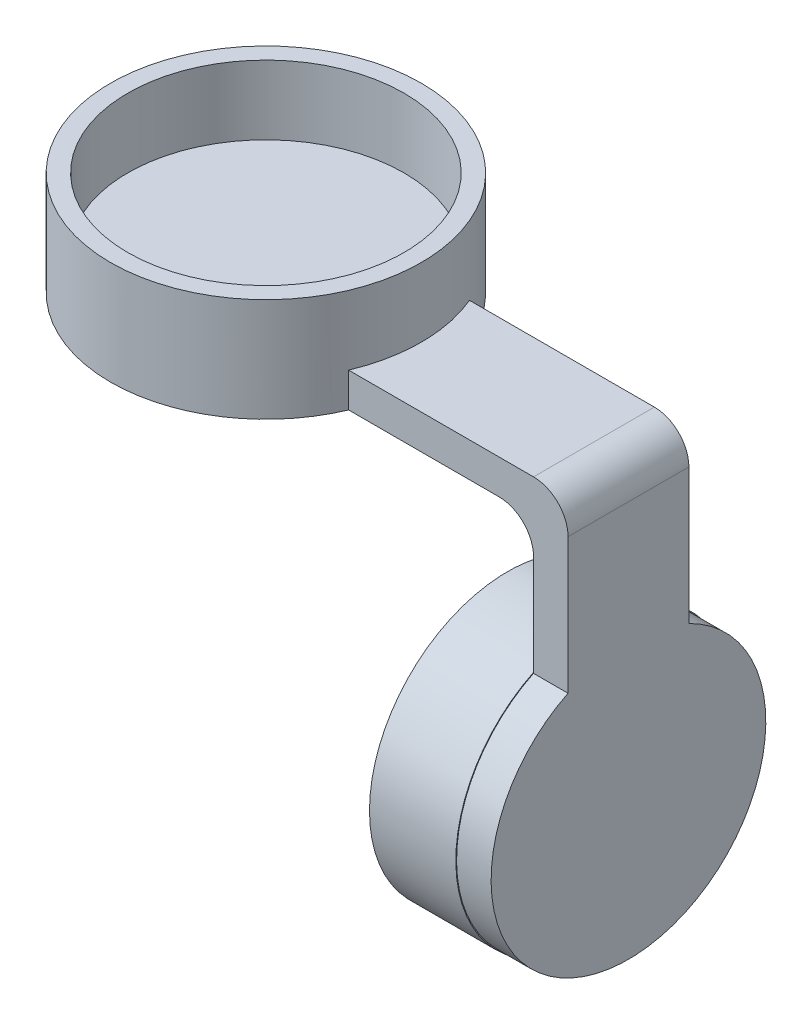
ISO-10303-21;
HEADER;
FILE_DESCRIPTION(('STEP AP214'),'2;1');
FILE_NAME('part.step','',(''),(''),'','','');
FILE_SCHEMA(('AUTOMOTIVE_DESIGN { 1 0 10303 214 1 1 1 1 }'));
ENDSEC;
DATA;
#1=APPLICATION_CONTEXT('core data for automotive mechanical design processes');
#2=APPLICATION_PROTOCOL_DEFINITION('international standard','automotive_design',2000,#1);
#3=PRODUCT_CONTEXT('',#1,'mechanical');
#4=PRODUCT('Part','Part','',(#3));
#5=PRODUCT_RELATED_PRODUCT_CATEGORY('part','',(#4));
#6=PRODUCT_DEFINITION_FORMATION('','',#4);
#7=PRODUCT_DEFINITION_CONTEXT('part definition',#1,'design');
#8=PRODUCT_DEFINITION('design','',#6,#7);
#9=PRODUCT_DEFINITION_SHAPE('','',#8);
#10=(LENGTH_UNIT() NAMED_UNIT(*) SI_UNIT(.MILLI.,.METRE.));
#11=(NAMED_UNIT(*) PLANE_ANGLE_UNIT() SI_UNIT($,.RADIAN.));
#12=(NAMED_UNIT(*) SI_UNIT($,.STERADIAN.) SOLID_ANGLE_UNIT());
#13=UNCERTAINTY_MEASURE_WITH_UNIT(LENGTH_MEASURE(1.E-05),#10,'distance_accuracy_value','');
#14=(GEOMETRIC_REPRESENTATION_CONTEXT(3) GLOBAL_UNCERTAINTY_ASSIGNED_CONTEXT((#13)) GLOBAL_UNIT_ASSIGNED_CONTEXT((#10,
#11,#12)) REPRESENTATION_CONTEXT('',''));
#15=CARTESIAN_POINT('',(0.,0.,0.));
#16=DIRECTION('',(0.,0.,1.));
#17=DIRECTION('',(1.,0.,0.));
#18=AXIS2_PLACEMENT_3D('',#15,#16,#17);
#19=CARTESIAN_POINT('',(-10.,0.,0.));
#20=DIRECTION('',(1.,0.,0.));
#21=DIRECTION('',(0.,0.,-1.));
#22=AXIS2_PLACEMENT_3D('',#19,#20,#21);
#23=CYLINDRICAL_SURFACE('',#22,16.);
#24=CARTESIAN_POINT('',(-10.,0.,0.));
#25=DIRECTION('',(1.,0.,0.));
#26=DIRECTION('',(0.,0.,-1.));
#27=AXIS2_PLACEMENT_3D('',#24,#25,#26);
#28=CIRCLE('',#27,16.);
#29=CARTESIAN_POINT('',(-10.,0.,-16.));
#30=VERTEX_POINT('',#29);
#31=EDGE_CURVE('E196',#30,#30,#28,.T.);
#32=ORIENTED_EDGE('',*,*,#31,.T.);
#33=EDGE_LOOP('',(#32));
#34=FACE_BOUND('',#33,.T.);
#35=CARTESIAN_POINT('',(0.,0.,0.));
#36=DIRECTION('',(1.,0.,0.));
#37=DIRECTION('',(0.,0.,-1.));
#38=AXIS2_PLACEMENT_3D('',#35,#36,#37);
#39=CIRCLE('',#38,16.);
#40=CARTESIAN_POINT('',(0.,14.3874945699382,-7.));
#41=VERTEX_POINT('',#40);
#42=CARTESIAN_POINT('',(0.,14.3874945699382,7.));
#43=VERTEX_POINT('',#42);
#44=EDGE_CURVE('E198',#41,#43,#39,.T.);
#45=ORIENTED_EDGE('',*,*,#44,.F.);
#46=EDGE_CURVE('E193',#43,#41,#39,.T.);
#47=ORIENTED_EDGE('',*,*,#46,.F.);
#48=EDGE_LOOP('',(#45,#47));
#49=FACE_BOUND('',#48,.T.);
#50=ADVANCED_FACE('F43',(#34,#49),#23,.T.);
#51=CARTESIAN_POINT('',(-10.,0.,0.));
#52=DIRECTION('',(1.,0.,0.));
#53=DIRECTION('',(0.,0.,-1.));
#54=AXIS2_PLACEMENT_3D('',#51,#52,#53);
#55=PLANE('',#54);
#56=CARTESIAN_POINT('',(-10.,0.,0.));
#57=DIRECTION('',(1.,0.,0.));
#58=DIRECTION('',(0.,0.,-1.));
#59=AXIS2_PLACEMENT_3D('',#56,#57,#58);
#60=CIRCLE('',#59,14.);
#61=CARTESIAN_POINT('',(-10.,0.,-14.));
#62=VERTEX_POINT('',#61);
#63=EDGE_CURVE('E190',#62,#62,#60,.T.);
#64=ORIENTED_EDGE('',*,*,#63,.T.);
#65=EDGE_LOOP('',(#64));
#66=FACE_BOUND('',#65,.T.);
#67=ORIENTED_EDGE('',*,*,#31,.F.);
#68=EDGE_LOOP('',(#67));
#69=FACE_BOUND('',#68,.T.);
#70=ADVANCED_FACE('F235',(#66,#69),#55,.F.);
#71=CARTESIAN_POINT('',(0.,0.,0.));
#72=DIRECTION('',(1.,0.,0.));
#73=DIRECTION('',(0.,0.,-1.));
#74=AXIS2_PLACEMENT_3D('',#71,#72,#73);
#75=PLANE('',#74);
#76=DIRECTION('',(0.,1.,0.));
#77=VECTOR('',#76,1.);
#78=CARTESIAN_POINT('',(0.,14.2889435024674,-7.));
#79=LINE('',#78,#77);
#80=CARTESIAN_POINT('',(0.,14.2889435024674,-7.));
#81=VERTEX_POINT('',#80);
#82=EDGE_CURVE('E176',#81,#41,#79,.T.);
#83=ORIENTED_EDGE('',*,*,#82,.F.);
#84=CARTESIAN_POINT('',(0.,0.,0.));
#85=DIRECTION('',(1.,0.,0.));
#86=DIRECTION('',(0.,0.,-1.));
#87=AXIS2_PLACEMENT_3D('',#84,#85,#86);
#88=CIRCLE('',#87,15.9114394828596);
#89=CARTESIAN_POINT('',(0.,14.2889435024674,7.));
#90=VERTEX_POINT('',#89);
#91=EDGE_CURVE('E171',#90,#81,#88,.T.);
#92=ORIENTED_EDGE('',*,*,#91,.F.);
#93=DIRECTION('',(0.,-1.,0.));
#94=VECTOR('',#93,1.);
#95=CARTESIAN_POINT('',(0.,14.2889435024674,7.));
#96=LINE('',#95,#94);
#97=EDGE_CURVE('E50',#43,#90,#96,.T.);
#98=ORIENTED_EDGE('',*,*,#97,.F.);
#99=ORIENTED_EDGE('',*,*,#46,.T.);
#100=EDGE_LOOP('',(#83,#92,#98,#99));
#101=FACE_BOUND('',#100,.T.);
#102=ADVANCED_FACE('F205',(#101),#75,.T.);
#103=CARTESIAN_POINT('',(-10.,0.,0.));
#104=DIRECTION('',(1.,0.,0.));
#105=DIRECTION('',(0.,0.,-1.));
#106=AXIS2_PLACEMENT_3D('',#103,#104,#105);
#107=CYLINDRICAL_SURFACE('',#106,14.);
#108=ORIENTED_EDGE('',*,*,#63,.F.);
#109=EDGE_LOOP('',(#108));
#110=FACE_BOUND('',#109,.T.);
#111=CARTESIAN_POINT('',(0.,0.,0.));
#112=DIRECTION('',(1.,0.,0.));
#113=DIRECTION('',(0.,0.,-1.));
#114=AXIS2_PLACEMENT_3D('',#111,#112,#113);
#115=CIRCLE('',#114,14.);
#116=CARTESIAN_POINT('',(0.,0.,-14.));
#117=VERTEX_POINT('',#116);
#118=EDGE_CURVE('E189',#117,#117,#115,.T.);
#119=ORIENTED_EDGE('',*,*,#118,.T.);
#120=EDGE_LOOP('',(#119));
#121=FACE_BOUND('',#120,.T.);
#122=ADVANCED_FACE('F247',(#110,#121),#107,.F.);
#123=CARTESIAN_POINT('',(4.,0.,0.));
#124=DIRECTION('',(1.,0.,0.));
#125=DIRECTION('',(0.,0.,-1.));
#126=AXIS2_PLACEMENT_3D('',#123,#124,#125);
#127=PLANE('',#126);
#128=DIRECTION('',(0.,1.,0.));
#129=VECTOR('',#128,1.);
#130=CARTESIAN_POINT('',(4.,14.2889435024674,-7.));
#131=LINE('',#130,#129);
#132=CARTESIAN_POINT('',(4.,14.2889435024674,-7.));
#133=VERTEX_POINT('',#132);
#134=CARTESIAN_POINT('',(4.,30.,-7.));
#135=VERTEX_POINT('',#134);
#136=EDGE_CURVE('E168',#133,#135,#131,.T.);
#137=ORIENTED_EDGE('',*,*,#136,.T.);
#138=DIRECTION('',(0.,0.,-1.));
#139=VECTOR('',#138,1.);
#140=CARTESIAN_POINT('',(4.,30.,7.));
#141=LINE('',#140,#139);
#142=CARTESIAN_POINT('',(4.,30.,7.));
#143=VERTEX_POINT('',#142);
#144=EDGE_CURVE('E158',#143,#135,#141,.T.);
#145=ORIENTED_EDGE('',*,*,#144,.F.);
#146=DIRECTION('',(0.,-1.,0.));
#147=VECTOR('',#146,1.);
#148=CARTESIAN_POINT('',(4.,14.2889435024674,7.));
#149=LINE('',#148,#147);
#150=CARTESIAN_POINT('',(4.,14.2889435024674,7.));
#151=VERTEX_POINT('',#150);
#152=EDGE_CURVE('E170',#143,#151,#149,.T.);
#153=ORIENTED_EDGE('',*,*,#152,.T.);
#154=CARTESIAN_POINT('',(4.,0.,0.));
#155=DIRECTION('',(1.,0.,0.));
#156=DIRECTION('',(0.,0.,-1.));
#157=AXIS2_PLACEMENT_3D('',#154,#155,#156);
#158=CIRCLE('',#157,15.9114394828596);
#159=EDGE_CURVE('E173',#151,#133,#158,.T.);
#160=ORIENTED_EDGE('',*,*,#159,.T.);
#161=EDGE_LOOP('',(#137,#145,#153,#160));
#162=FACE_BOUND('',#161,.T.);
#163=ADVANCED_FACE('F251',(#162),#127,.T.);
#164=CARTESIAN_POINT('',(4.,0.,0.));
#165=DIRECTION('',(-1.,0.,0.));
#166=DIRECTION('',(0.,0.,1.));
#167=AXIS2_PLACEMENT_3D('',#164,#165,#166);
#168=CYLINDRICAL_SURFACE('',#167,15.9114394828596);
#169=ORIENTED_EDGE('',*,*,#91,.T.);
#170=DIRECTION('',(-1.,0.,0.));
#171=VECTOR('',#170,1.);
#172=CARTESIAN_POINT('',(4.,14.2889435024674,-7.));
#173=LINE('',#172,#171);
#174=EDGE_CURVE('E175',#133,#81,#173,.T.);
#175=ORIENTED_EDGE('',*,*,#174,.F.);
#176=ORIENTED_EDGE('',*,*,#159,.F.);
#177=DIRECTION('',(-1.,0.,0.));
#178=VECTOR('',#177,1.);
#179=CARTESIAN_POINT('',(4.,14.2889435024674,7.));
#180=LINE('',#179,#178);
#181=EDGE_CURVE('E186',#151,#90,#180,.T.);
#182=ORIENTED_EDGE('',*,*,#181,.T.);
#183=EDGE_LOOP('',(#169,#175,#176,#182));
#184=FACE_BOUND('',#183,.T.);
#185=ADVANCED_FACE('F216',(#184),#168,.T.);
#186=CARTESIAN_POINT('',(4.,14.2889435024674,7.));
#187=DIRECTION('',(0.,0.,-1.));
#188=DIRECTION('',(-1.,0.,0.));
#189=AXIS2_PLACEMENT_3D('',#186,#187,#188);
#190=PLANE('',#189);
#191=DIRECTION('',(1.,0.,0.));
#192=VECTOR('',#191,1.);
#193=CARTESIAN_POINT('',(0.,34.,7.));
#194=LINE('',#193,#192);
#195=CARTESIAN_POINT('',(-21.416876048223,34.,7.));
#196=VERTEX_POINT('',#195);
#197=CARTESIAN_POINT('',(0.,34.,7.));
#198=VERTEX_POINT('',#197);
#199=EDGE_CURVE('E123',#196,#198,#194,.T.);
#200=ORIENTED_EDGE('',*,*,#199,.F.);
#201=DIRECTION('',(0.,1.,0.));
#202=VECTOR('',#201,1.);
#203=CARTESIAN_POINT('',(-21.416876048223,30.,7.));
#204=LINE('',#203,#202);
#205=CARTESIAN_POINT('',(-21.416876048223,30.,7.));
#206=VERTEX_POINT('',#205);
#207=EDGE_CURVE('E65',#196,#206,#204,.F.);
#208=ORIENTED_EDGE('',*,*,#207,.T.);
#209=DIRECTION('',(-1.,0.,0.));
#210=VECTOR('',#209,1.);
#211=CARTESIAN_POINT('',(-4.00000000000003,30.,7.));
#212=LINE('',#211,#210);
#213=CARTESIAN_POINT('',(-4.00000000000003,30.,7.));
#214=VERTEX_POINT('',#213);
#215=EDGE_CURVE('E130',#214,#206,#212,.T.);
#216=ORIENTED_EDGE('',*,*,#215,.F.);
#217=CARTESIAN_POINT('',(-4.,26.,7.));
#218=DIRECTION('',(0.,0.,1.));
#219=DIRECTION('',(1.,0.,0.));
#220=AXIS2_PLACEMENT_3D('',#217,#218,#219);
#221=CIRCLE('',#220,4.);
#222=CARTESIAN_POINT('',(0.,26.,7.));
#223=VERTEX_POINT('',#222);
#224=EDGE_CURVE('E144',#223,#214,#221,.T.);
#225=ORIENTED_EDGE('',*,*,#224,.F.);
#226=EDGE_CURVE('E179',#223,#43,#96,.T.);
#227=ORIENTED_EDGE('',*,*,#226,.T.);
#228=ORIENTED_EDGE('',*,*,#97,.T.);
#229=ORIENTED_EDGE('',*,*,#181,.F.);
#230=ORIENTED_EDGE('',*,*,#152,.F.);
#231=CARTESIAN_POINT('',(0.,30.,7.));
#232=DIRECTION('',(0.,0.,-1.));
#233=DIRECTION('',(1.,0.,0.));
#234=AXIS2_PLACEMENT_3D('',#231,#232,#233);
#235=CIRCLE('',#234,4.);
#236=EDGE_CURVE('E126',#198,#143,#235,.T.);
#237=ORIENTED_EDGE('',*,*,#236,.F.);
#238=EDGE_LOOP('',(#200,#208,#216,#225,#227,#228,#229,#230,#237));
#239=FACE_BOUND('',#238,.T.);
#240=ADVANCED_FACE('F124',(#239),#190,.F.);
#241=CARTESIAN_POINT('',(4.,14.2889435024674,-7.));
#242=DIRECTION('',(0.,0.,1.));
#243=DIRECTION('',(1.,0.,0.));
#244=AXIS2_PLACEMENT_3D('',#241,#242,#243);
#245=PLANE('',#244);
#246=DIRECTION('',(-1.,0.,0.));
#247=VECTOR('',#246,1.);
#248=CARTESIAN_POINT('',(-4.00000000000003,30.,-7.));
#249=LINE('',#248,#247);
#250=CARTESIAN_POINT('',(-4.00000000000003,30.,-7.));
#251=VERTEX_POINT('',#250);
#252=CARTESIAN_POINT('',(-21.416876048223,30.,-7.));
#253=VERTEX_POINT('',#252);
#254=EDGE_CURVE('E153',#251,#253,#249,.T.);
#255=ORIENTED_EDGE('',*,*,#254,.T.);
#256=DIRECTION('',(0.,1.,0.));
#257=VECTOR('',#256,1.);
#258=CARTESIAN_POINT('',(-21.416876048223,30.,-7.));
#259=LINE('',#258,#257);
#260=CARTESIAN_POINT('',(-21.416876048223,34.,-7.));
#261=VERTEX_POINT('',#260);
#262=EDGE_CURVE('E57',#253,#261,#259,.T.);
#263=ORIENTED_EDGE('',*,*,#262,.T.);
#264=DIRECTION('',(1.,0.,0.));
#265=VECTOR('',#264,1.);
#266=CARTESIAN_POINT('',(0.,34.,-7.));
#267=LINE('',#266,#265);
#268=CARTESIAN_POINT('',(0.,34.,-7.));
#269=VERTEX_POINT('',#268);
#270=EDGE_CURVE('E133',#261,#269,#267,.T.);
#271=ORIENTED_EDGE('',*,*,#270,.T.);
#272=CARTESIAN_POINT('',(0.,30.,-7.));
#273=DIRECTION('',(0.,0.,-1.));
#274=DIRECTION('',(1.,0.,0.));
#275=AXIS2_PLACEMENT_3D('',#272,#273,#274);
#276=CIRCLE('',#275,4.);
#277=EDGE_CURVE('E147',#269,#135,#276,.T.);
#278=ORIENTED_EDGE('',*,*,#277,.T.);
#279=ORIENTED_EDGE('',*,*,#136,.F.);
#280=ORIENTED_EDGE('',*,*,#174,.T.);
#281=ORIENTED_EDGE('',*,*,#82,.T.);
#282=CARTESIAN_POINT('',(0.,26.,-7.));
#283=VERTEX_POINT('',#282);
#284=EDGE_CURVE('E161',#41,#283,#79,.T.);
#285=ORIENTED_EDGE('',*,*,#284,.T.);
#286=CARTESIAN_POINT('',(-4.,26.,-7.));
#287=DIRECTION('',(0.,0.,1.));
#288=DIRECTION('',(1.,0.,0.));
#289=AXIS2_PLACEMENT_3D('',#286,#287,#288);
#290=CIRCLE('',#289,4.);
#291=EDGE_CURVE('E120',#283,#251,#290,.T.);
#292=ORIENTED_EDGE('',*,*,#291,.T.);
#293=EDGE_LOOP('',(#255,#263,#271,#278,#279,#280,#281,#285,#292));
#294=FACE_BOUND('',#293,.T.);
#295=ADVANCED_FACE('F211',(#294),#245,.F.);
#296=CARTESIAN_POINT('',(0.,0.,0.));
#297=DIRECTION('',(1.,0.,0.));
#298=DIRECTION('',(0.,0.,-1.));
#299=AXIS2_PLACEMENT_3D('',#296,#297,#298);
#300=PLANE('',#299);
#301=ORIENTED_EDGE('',*,*,#284,.F.);
#302=ORIENTED_EDGE('',*,*,#44,.T.);
#303=ORIENTED_EDGE('',*,*,#226,.F.);
#304=DIRECTION('',(0.,0.,-1.));
#305=VECTOR('',#304,1.);
#306=CARTESIAN_POINT('',(0.,26.,7.));
#307=LINE('',#306,#305);
#308=EDGE_CURVE('E150',#223,#283,#307,.T.);
#309=ORIENTED_EDGE('',*,*,#308,.T.);
#310=EDGE_LOOP('',(#301,#302,#303,#309));
#311=FACE_BOUND('',#310,.T.);
#312=ADVANCED_FACE('F208',(#311),#300,.F.);
#313=ORIENTED_EDGE('',*,*,#118,.F.);
#314=EDGE_LOOP('',(#313));
#315=FACE_BOUND('',#314,.T.);
#316=ADVANCED_FACE('F259',(#315),#300,.F.);
#317=CARTESIAN_POINT('',(0.,30.,7.));
#318=DIRECTION('',(0.,0.,-1.));
#319=DIRECTION('',(-1.,0.,0.));
#320=AXIS2_PLACEMENT_3D('',#317,#318,#319);
#321=CYLINDRICAL_SURFACE('',#320,4.);
#322=ORIENTED_EDGE('',*,*,#277,.F.);
#323=DIRECTION('',(0.,0.,-1.));
#324=VECTOR('',#323,1.);
#325=CARTESIAN_POINT('',(0.,34.,7.));
#326=LINE('',#325,#324);
#327=EDGE_CURVE('E162',#198,#269,#326,.T.);
#328=ORIENTED_EDGE('',*,*,#327,.F.);
#329=ORIENTED_EDGE('',*,*,#236,.T.);
#330=ORIENTED_EDGE('',*,*,#144,.T.);
#331=EDGE_LOOP('',(#322,#328,#329,#330));
#332=FACE_BOUND('',#331,.T.);
#333=ADVANCED_FACE('F231',(#332),#321,.T.);
#334=CARTESIAN_POINT('',(0.,34.,7.));
#335=DIRECTION('',(0.,1.,0.));
#336=DIRECTION('',(0.,0.,1.));
#337=AXIS2_PLACEMENT_3D('',#334,#335,#336);
#338=PLANE('',#337);
#339=ORIENTED_EDGE('',*,*,#270,.F.);
#340=CARTESIAN_POINT('',(-38.,34.,0.));
#341=DIRECTION('',(0.,1.,0.));
#342=DIRECTION('',(0.,0.,1.));
#343=AXIS2_PLACEMENT_3D('',#340,#341,#342);
#344=CIRCLE('',#343,18.);
#345=EDGE_CURVE('E117',#196,#261,#344,.T.);
#346=ORIENTED_EDGE('',*,*,#345,.F.);
#347=ORIENTED_EDGE('',*,*,#199,.T.);
#348=ORIENTED_EDGE('',*,*,#327,.T.);
#349=EDGE_LOOP('',(#339,#346,#347,#348));
#350=FACE_BOUND('',#349,.T.);
#351=ADVANCED_FACE('F132',(#350),#338,.T.);
#352=CARTESIAN_POINT('',(-4.00000000000003,30.,7.));
#353=DIRECTION('',(0.,-1.,0.));
#354=DIRECTION('',(0.,0.,-1.));
#355=AXIS2_PLACEMENT_3D('',#352,#353,#354);
#356=PLANE('',#355);
#357=ORIENTED_EDGE('',*,*,#215,.T.);
#358=CARTESIAN_POINT('',(-38.,30.,0.));
#359=DIRECTION('',(0.,1.,0.));
#360=DIRECTION('',(0.,0.,1.));
#361=AXIS2_PLACEMENT_3D('',#358,#359,#360);
#362=CIRCLE('',#361,18.);
#363=EDGE_CURVE('E119',#253,#206,#362,.T.);
#364=ORIENTED_EDGE('',*,*,#363,.F.);
#365=ORIENTED_EDGE('',*,*,#254,.F.);
#366=DIRECTION('',(0.,0.,-1.));
#367=VECTOR('',#366,1.);
#368=CARTESIAN_POINT('',(-4.00000000000003,30.,7.));
#369=LINE('',#368,#367);
#370=EDGE_CURVE('E164',#214,#251,#369,.T.);
#371=ORIENTED_EDGE('',*,*,#370,.F.);
#372=EDGE_LOOP('',(#357,#364,#365,#371));
#373=FACE_BOUND('',#372,.T.);
#374=ADVANCED_FACE('F223',(#373),#356,.T.);
#375=CARTESIAN_POINT('',(-4.,26.,7.));
#376=DIRECTION('',(0.,0.,-1.));
#377=DIRECTION('',(-1.,0.,0.));
#378=AXIS2_PLACEMENT_3D('',#375,#376,#377);
#379=CYLINDRICAL_SURFACE('',#378,4.);
#380=ORIENTED_EDGE('',*,*,#291,.F.);
#381=ORIENTED_EDGE('',*,*,#308,.F.);
#382=ORIENTED_EDGE('',*,*,#224,.T.);
#383=ORIENTED_EDGE('',*,*,#370,.T.);
#384=EDGE_LOOP('',(#380,#381,#382,#383));
#385=FACE_BOUND('',#384,.T.);
#386=ADVANCED_FACE('F220',(#385),#379,.F.);
#387=CARTESIAN_POINT('',(-38.,30.,0.));
#388=DIRECTION('',(0.,1.,0.));
#389=DIRECTION('',(0.,0.,1.));
#390=AXIS2_PLACEMENT_3D('',#387,#388,#389);
#391=CYLINDRICAL_SURFACE('',#390,18.);
#392=ORIENTED_EDGE('',*,*,#207,.F.);
#393=ORIENTED_EDGE('',*,*,#345,.T.);
#394=ORIENTED_EDGE('',*,*,#262,.F.);
#395=ORIENTED_EDGE('',*,*,#363,.T.);
#396=EDGE_LOOP('',(#392,#393,#394,#395));
#397=FACE_BOUND('',#396,.T.);
#398=CARTESIAN_POINT('',(-38.,42.,0.));
#399=DIRECTION('',(0.,1.,0.));
#400=DIRECTION('',(0.,0.,1.));
#401=AXIS2_PLACEMENT_3D('',#398,#399,#400);
#402=CIRCLE('',#401,18.);
#403=CARTESIAN_POINT('',(-38.,42.,18.));
#404=VERTEX_POINT('',#403);
#405=EDGE_CURVE('E134',#404,#404,#402,.T.);
#406=ORIENTED_EDGE('',*,*,#405,.F.);
#407=EDGE_LOOP('',(#406));
#408=FACE_BOUND('',#407,.T.);
#409=ADVANCED_FACE('F114',(#397,#408),#391,.T.);
#410=CARTESIAN_POINT('',(-38.,42.,0.));
#411=DIRECTION('',(0.,1.,0.));
#412=DIRECTION('',(0.,0.,1.));
#413=AXIS2_PLACEMENT_3D('',#410,#411,#412);
#414=PLANE('',#413);
#415=ORIENTED_EDGE('',*,*,#405,.T.);
#416=EDGE_LOOP('',(#415));
#417=FACE_BOUND('',#416,.T.);
#418=CARTESIAN_POINT('',(-38.,42.,0.));
#419=DIRECTION('',(0.,1.,0.));
#420=DIRECTION('',(0.,0.,1.));
#421=AXIS2_PLACEMENT_3D('',#418,#419,#420);
#422=CIRCLE('',#421,16.);
#423=CARTESIAN_POINT('',(-38.,42.,16.));
#424=VERTEX_POINT('',#423);
#425=EDGE_CURVE('E135',#424,#424,#422,.T.);
#426=ORIENTED_EDGE('',*,*,#425,.F.);
#427=EDGE_LOOP('',(#426));
#428=FACE_BOUND('',#427,.T.);
#429=ADVANCED_FACE('F277',(#417,#428),#414,.T.);
#430=CARTESIAN_POINT('',(-38.,42.,0.));
#431=DIRECTION('',(0.,-1.,0.));
#432=DIRECTION('',(0.,0.,-1.));
#433=AXIS2_PLACEMENT_3D('',#430,#431,#432);
#434=CYLINDRICAL_SURFACE('',#433,16.);
#435=ORIENTED_EDGE('',*,*,#425,.T.);
#436=EDGE_LOOP('',(#435));
#437=FACE_BOUND('',#436,.T.);
#438=CARTESIAN_POINT('',(-38.,34.,0.));
#439=DIRECTION('',(0.,1.,0.));
#440=DIRECTION('',(0.,0.,1.));
#441=AXIS2_PLACEMENT_3D('',#438,#439,#440);
#442=CIRCLE('',#441,16.);
#443=CARTESIAN_POINT('',(-38.,34.,16.));
#444=VERTEX_POINT('',#443);
#445=EDGE_CURVE('E11',#444,#444,#442,.F.);
#446=ORIENTED_EDGE('',*,*,#445,.T.);
#447=EDGE_LOOP('',(#446));
#448=FACE_BOUND('',#447,.T.);
#449=ADVANCED_FACE('F280',(#437,#448),#434,.F.);
#450=ORIENTED_EDGE('',*,*,#445,.F.);
#451=EDGE_LOOP('',(#450));
#452=FACE_BOUND('',#451,.T.);
#453=ADVANCED_FACE('F233',(#452),#338,.T.);
#454=CLOSED_SHELL('',(#50,#70,#102,#122,#163,#185,#240,#295,#312,#316,#333,#351,#374,#386,#409,
#429,#449,#453));
#455=MANIFOLD_SOLID_BREP('B2',#454);
#456=ADVANCED_BREP_SHAPE_REPRESENTATION('',(#18,#455),#14);
#457=SHAPE_DEFINITION_REPRESENTATION(#9,#456);
ENDSEC;
END-ISO-10303-21;
